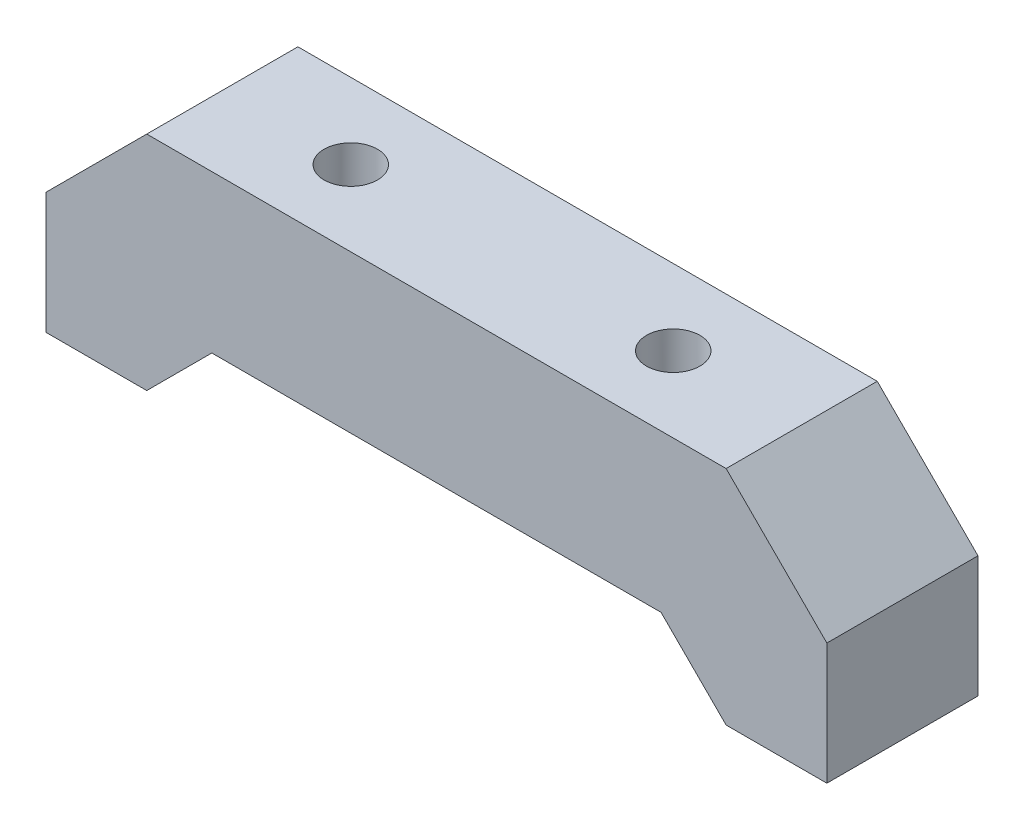
ISO-10303-21;
HEADER;
FILE_DESCRIPTION(('STEP AP214'),'2;1');
FILE_NAME('part.step','',(''),(''),'','','');
FILE_SCHEMA(('AUTOMOTIVE_DESIGN { 1 0 10303 214 1 1 1 1 }'));
ENDSEC;
DATA;
#1=APPLICATION_CONTEXT('core data for automotive mechanical design processes');
#2=APPLICATION_PROTOCOL_DEFINITION('international standard','automotive_design',2000,#1);
#3=PRODUCT_CONTEXT('',#1,'mechanical');
#4=PRODUCT('Part','Part','',(#3));
#5=PRODUCT_RELATED_PRODUCT_CATEGORY('part','',(#4));
#6=PRODUCT_DEFINITION_FORMATION('','',#4);
#7=PRODUCT_DEFINITION_CONTEXT('part definition',#1,'design');
#8=PRODUCT_DEFINITION('design','',#6,#7);
#9=PRODUCT_DEFINITION_SHAPE('','',#8);
#10=(LENGTH_UNIT() NAMED_UNIT(*) SI_UNIT(.MILLI.,.METRE.));
#11=(NAMED_UNIT(*) PLANE_ANGLE_UNIT() SI_UNIT($,.RADIAN.));
#12=(NAMED_UNIT(*) SI_UNIT($,.STERADIAN.) SOLID_ANGLE_UNIT());
#13=UNCERTAINTY_MEASURE_WITH_UNIT(LENGTH_MEASURE(1.E-05),#10,'distance_accuracy_value','');
#14=(GEOMETRIC_REPRESENTATION_CONTEXT(3) GLOBAL_UNCERTAINTY_ASSIGNED_CONTEXT((#13)) GLOBAL_UNIT_ASSIGNED_CONTEXT((#10,
#11,#12)) REPRESENTATION_CONTEXT('',''));
#15=CARTESIAN_POINT('',(0.,0.,0.));
#16=DIRECTION('',(0.,0.,1.));
#17=DIRECTION('',(1.,0.,0.));
#18=AXIS2_PLACEMENT_3D('',#15,#16,#17);
#19=CARTESIAN_POINT('',(22.8530411232495,-13.2789727585112,7.5));
#20=DIRECTION('',(0.,1.,0.));
#21=DIRECTION('',(0.,0.,1.));
#22=AXIS2_PLACEMENT_3D('',#19,#20,#21);
#23=CYLINDRICAL_SURFACE('',#22,2.65);
#24=CARTESIAN_POINT('',(22.8530411232495,8.76930503233844,7.5));
#25=DIRECTION('',(0.,1.,0.));
#26=DIRECTION('',(0.,0.,1.));
#27=AXIS2_PLACEMENT_3D('',#24,#25,#26);
#28=CIRCLE('',#27,2.65);
#29=CARTESIAN_POINT('',(22.8530411232495,8.76930503233844,10.15));
#30=VERTEX_POINT('',#29);
#31=EDGE_CURVE('E143',#30,#30,#28,.T.);
#32=ORIENTED_EDGE('',*,*,#31,.T.);
#33=EDGE_LOOP('',(#32));
#34=FACE_BOUND('',#33,.T.);
#35=CARTESIAN_POINT('',(22.8530411232495,-1.82118170705608,7.5));
#36=DIRECTION('',(0.,-1.,0.));
#37=DIRECTION('',(0.,0.,-1.));
#38=AXIS2_PLACEMENT_3D('',#35,#36,#37);
#39=CIRCLE('',#38,2.65);
#40=CARTESIAN_POINT('',(22.8530411232495,-1.82118170705608,4.85));
#41=VERTEX_POINT('',#40);
#42=EDGE_CURVE('E176',#41,#41,#39,.F.);
#43=ORIENTED_EDGE('',*,*,#42,.F.);
#44=EDGE_LOOP('',(#43));
#45=FACE_BOUND('',#44,.T.);
#46=ADVANCED_FACE('F31',(#34,#45),#23,.F.);
#47=CARTESIAN_POINT('',(90.1472529815433,-13.7749068259554,15.));
#48=DIRECTION('',(0.707106781186547,0.707106781186548,0.));
#49=DIRECTION('',(-0.707106781186548,0.707106781186547,0.));
#50=AXIS2_PLACEMENT_3D('',#47,#48,#49);
#51=PLANE('',#50);
#52=DIRECTION('',(0.707106781186548,-0.707106781186547,0.));
#53=VECTOR('',#52,1.);
#54=CARTESIAN_POINT('',(90.1472529815433,-13.7749068259554,0.));
#55=LINE('',#54,#53);
#56=CARTESIAN_POINT('',(67.6030411232495,8.76930503233844,0.));
#57=VERTEX_POINT('',#56);
#58=CARTESIAN_POINT('',(77.6030411232495,-1.23069496766157,0.));
#59=VERTEX_POINT('',#58);
#60=EDGE_CURVE('E139',#57,#59,#55,.T.);
#61=ORIENTED_EDGE('',*,*,#60,.F.);
#62=DIRECTION('',(0.,0.,-1.));
#63=VECTOR('',#62,1.);
#64=CARTESIAN_POINT('',(67.6030411232495,8.76930503233844,15.));
#65=LINE('',#64,#63);
#66=CARTESIAN_POINT('',(67.6030411232495,8.76930503233844,15.));
#67=VERTEX_POINT('',#66);
#68=EDGE_CURVE('E11',#67,#57,#65,.T.);
#69=ORIENTED_EDGE('',*,*,#68,.F.);
#70=DIRECTION('',(0.707106781186548,-0.707106781186547,0.));
#71=VECTOR('',#70,1.);
#72=CARTESIAN_POINT('',(90.1472529815433,-13.7749068259554,15.));
#73=LINE('',#72,#71);
#74=CARTESIAN_POINT('',(77.6030411232495,-1.23069496766157,15.));
#75=VERTEX_POINT('',#74);
#76=EDGE_CURVE('E162',#67,#75,#73,.T.);
#77=ORIENTED_EDGE('',*,*,#76,.T.);
#78=DIRECTION('',(0.,0.,-1.));
#79=VECTOR('',#78,1.);
#80=CARTESIAN_POINT('',(77.6030411232495,-1.23069496766157,15.));
#81=LINE('',#80,#79);
#82=EDGE_CURVE('E91',#75,#59,#81,.T.);
#83=ORIENTED_EDGE('',*,*,#82,.T.);
#84=EDGE_LOOP('',(#61,#69,#77,#83));
#85=FACE_BOUND('',#84,.T.);
#86=ADVANCED_FACE('F33',(#85),#51,.T.);
#87=CARTESIAN_POINT('',(38.8530411232495,8.76930503233844,15.));
#88=DIRECTION('',(0.,1.,0.));
#89=DIRECTION('',(0.,0.,1.));
#90=AXIS2_PLACEMENT_3D('',#87,#88,#89);
#91=PLANE('',#90);
#92=CARTESIAN_POINT('',(54.8530411232495,8.76930503233844,7.5));
#93=DIRECTION('',(0.,1.,0.));
#94=DIRECTION('',(0.,0.,-1.));
#95=AXIS2_PLACEMENT_3D('',#92,#93,#94);
#96=CIRCLE('',#95,2.65);
#97=CARTESIAN_POINT('',(54.8530411232495,8.76930503233844,4.85));
#98=VERTEX_POINT('',#97);
#99=EDGE_CURVE('E178',#98,#98,#96,.T.);
#100=ORIENTED_EDGE('',*,*,#99,.F.);
#101=EDGE_LOOP('',(#100));
#102=FACE_BOUND('',#101,.T.);
#103=ORIENTED_EDGE('',*,*,#31,.F.);
#104=EDGE_LOOP('',(#103));
#105=FACE_BOUND('',#104,.T.);
#106=DIRECTION('',(1.,0.,0.));
#107=VECTOR('',#106,1.);
#108=CARTESIAN_POINT('',(38.8530411232495,8.76930503233844,0.));
#109=LINE('',#108,#107);
#110=CARTESIAN_POINT('',(10.1030411232495,8.76930503233844,0.));
#111=VERTEX_POINT('',#110);
#112=EDGE_CURVE('E142',#111,#57,#109,.T.);
#113=ORIENTED_EDGE('',*,*,#112,.F.);
#114=DIRECTION('',(0.,0.,-1.));
#115=VECTOR('',#114,1.);
#116=CARTESIAN_POINT('',(10.1030411232495,8.76930503233844,15.));
#117=LINE('',#116,#115);
#118=CARTESIAN_POINT('',(10.1030411232495,8.76930503233844,15.));
#119=VERTEX_POINT('',#118);
#120=EDGE_CURVE('E41',#119,#111,#117,.T.);
#121=ORIENTED_EDGE('',*,*,#120,.F.);
#122=DIRECTION('',(1.,0.,0.));
#123=VECTOR('',#122,1.);
#124=CARTESIAN_POINT('',(38.8530411232495,8.76930503233844,15.));
#125=LINE('',#124,#123);
#126=EDGE_CURVE('E198',#119,#67,#125,.T.);
#127=ORIENTED_EDGE('',*,*,#126,.T.);
#128=ORIENTED_EDGE('',*,*,#68,.T.);
#129=EDGE_LOOP('',(#113,#121,#127,#128));
#130=FACE_BOUND('',#129,.T.);
#131=ADVANCED_FACE('F242',(#102,#105,#130),#91,.T.);
#132=CARTESIAN_POINT('',(-12.4411707350443,-13.7749068259554,15.));
#133=DIRECTION('',(0.707106781186547,-0.707106781186547,0.));
#134=DIRECTION('',(0.707106781186548,0.707106781186548,0.));
#135=AXIS2_PLACEMENT_3D('',#132,#133,#134);
#136=PLANE('',#135);
#137=DIRECTION('',(-0.707106781186548,-0.707106781186548,0.));
#138=VECTOR('',#137,1.);
#139=CARTESIAN_POINT('',(-12.4411707350443,-13.7749068259554,0.));
#140=LINE('',#139,#138);
#141=CARTESIAN_POINT('',(0.103041123249546,-1.23069496766155,0.));
#142=VERTEX_POINT('',#141);
#143=EDGE_CURVE('E146',#111,#142,#140,.T.);
#144=ORIENTED_EDGE('',*,*,#143,.T.);
#145=DIRECTION('',(0.,0.,-1.));
#146=VECTOR('',#145,1.);
#147=CARTESIAN_POINT('',(0.103041123249546,-1.23069496766155,15.));
#148=LINE('',#147,#146);
#149=CARTESIAN_POINT('',(0.103041123249546,-1.23069496766155,15.));
#150=VERTEX_POINT('',#149);
#151=EDGE_CURVE('E173',#150,#142,#148,.T.);
#152=ORIENTED_EDGE('',*,*,#151,.F.);
#153=DIRECTION('',(-0.707106781186548,-0.707106781186548,0.));
#154=VECTOR('',#153,1.);
#155=CARTESIAN_POINT('',(-12.4411707350443,-13.7749068259554,15.));
#156=LINE('',#155,#154);
#157=EDGE_CURVE('E201',#119,#150,#156,.T.);
#158=ORIENTED_EDGE('',*,*,#157,.F.);
#159=ORIENTED_EDGE('',*,*,#120,.T.);
#160=EDGE_LOOP('',(#144,#152,#158,#159));
#161=FACE_BOUND('',#160,.T.);
#162=ADVANCED_FACE('F397',(#161),#136,.F.);
#163=CARTESIAN_POINT('',(0.103041123249527,-65.0691186842492,15.));
#164=DIRECTION('',(1.,0.,0.));
#165=DIRECTION('',(0.,0.,-1.));
#166=AXIS2_PLACEMENT_3D('',#163,#164,#165);
#167=PLANE('',#166);
#168=DIRECTION('',(0.,-1.,0.));
#169=VECTOR('',#168,1.);
#170=CARTESIAN_POINT('',(0.103041123249527,-65.0691186842492,0.));
#171=LINE('',#170,#169);
#172=CARTESIAN_POINT('',(0.103041123249527,-13.2789727585112,0.));
#173=VERTEX_POINT('',#172);
#174=EDGE_CURVE('E148',#142,#173,#171,.T.);
#175=ORIENTED_EDGE('',*,*,#174,.T.);
#176=DIRECTION('',(0.,0.,-1.));
#177=VECTOR('',#176,1.);
#178=CARTESIAN_POINT('',(0.103041123249527,-13.2789727585112,15.));
#179=LINE('',#178,#177);
#180=CARTESIAN_POINT('',(0.103041123249527,-13.2789727585112,15.));
#181=VERTEX_POINT('',#180);
#182=EDGE_CURVE('E170',#181,#173,#179,.T.);
#183=ORIENTED_EDGE('',*,*,#182,.F.);
#184=DIRECTION('',(0.,-1.,0.));
#185=VECTOR('',#184,1.);
#186=CARTESIAN_POINT('',(0.103041123249527,-65.0691186842492,15.));
#187=LINE('',#186,#185);
#188=EDGE_CURVE('E203',#150,#181,#187,.T.);
#189=ORIENTED_EDGE('',*,*,#188,.F.);
#190=ORIENTED_EDGE('',*,*,#151,.T.);
#191=EDGE_LOOP('',(#175,#183,#189,#190));
#192=FACE_BOUND('',#191,.T.);
#193=ADVANCED_FACE('F389',(#192),#167,.F.);
#194=CARTESIAN_POINT('',(38.8530411232495,-13.2789727585112,15.));
#195=DIRECTION('',(0.,1.,0.));
#196=DIRECTION('',(0.,0.,1.));
#197=AXIS2_PLACEMENT_3D('',#194,#195,#196);
#198=PLANE('',#197);
#199=DIRECTION('',(1.,0.,0.));
#200=VECTOR('',#199,1.);
#201=CARTESIAN_POINT('',(38.8530411232495,-13.2789727585112,0.));
#202=LINE('',#201,#200);
#203=CARTESIAN_POINT('',(10.1030411232495,-13.2789727585112,0.));
#204=VERTEX_POINT('',#203);
#205=EDGE_CURVE('E150',#173,#204,#202,.T.);
#206=ORIENTED_EDGE('',*,*,#205,.T.);
#207=DIRECTION('',(0.,0.,-1.));
#208=VECTOR('',#207,1.);
#209=CARTESIAN_POINT('',(10.1030411232495,-13.2789727585112,15.));
#210=LINE('',#209,#208);
#211=CARTESIAN_POINT('',(10.1030411232495,-13.2789727585112,15.));
#212=VERTEX_POINT('',#211);
#213=EDGE_CURVE('E168',#212,#204,#210,.T.);
#214=ORIENTED_EDGE('',*,*,#213,.F.);
#215=DIRECTION('',(1.,0.,0.));
#216=VECTOR('',#215,1.);
#217=CARTESIAN_POINT('',(38.8530411232495,-13.2789727585112,15.));
#218=LINE('',#217,#216);
#219=EDGE_CURVE('E205',#181,#212,#218,.T.);
#220=ORIENTED_EDGE('',*,*,#219,.F.);
#221=ORIENTED_EDGE('',*,*,#182,.T.);
#222=EDGE_LOOP('',(#206,#214,#220,#221));
#223=FACE_BOUND('',#222,.T.);
#224=ADVANCED_FACE('F217',(#223),#198,.F.);
#225=CARTESIAN_POINT('',(-1.41703183961947,-24.7990457213802,15.));
#226=DIRECTION('',(0.707106781186547,-0.707106781186547,0.));
#227=DIRECTION('',(0.707106781186548,0.707106781186548,0.));
#228=AXIS2_PLACEMENT_3D('',#225,#226,#227);
#229=PLANE('',#228);
#230=DIRECTION('',(-0.707106781186548,-0.707106781186548,0.));
#231=VECTOR('',#230,1.);
#232=CARTESIAN_POINT('',(-1.41703183961947,-24.7990457213802,0.));
#233=LINE('',#232,#231);
#234=CARTESIAN_POINT('',(16.5608321747046,-6.8211817070561,0.));
#235=VERTEX_POINT('',#234);
#236=EDGE_CURVE('E153',#235,#204,#233,.T.);
#237=ORIENTED_EDGE('',*,*,#236,.F.);
#238=DIRECTION('',(0.,0.,-1.));
#239=VECTOR('',#238,1.);
#240=CARTESIAN_POINT('',(16.5608321747046,-6.8211817070561,15.));
#241=LINE('',#240,#239);
#242=CARTESIAN_POINT('',(16.5608321747046,-6.8211817070561,15.));
#243=VERTEX_POINT('',#242);
#244=EDGE_CURVE('E166',#243,#235,#241,.T.);
#245=ORIENTED_EDGE('',*,*,#244,.F.);
#246=DIRECTION('',(-0.707106781186548,-0.707106781186548,0.));
#247=VECTOR('',#246,1.);
#248=CARTESIAN_POINT('',(-1.41703183961947,-24.7990457213802,15.));
#249=LINE('',#248,#247);
#250=EDGE_CURVE('E207',#243,#212,#249,.T.);
#251=ORIENTED_EDGE('',*,*,#250,.T.);
#252=ORIENTED_EDGE('',*,*,#213,.T.);
#253=EDGE_LOOP('',(#237,#245,#251,#252));
#254=FACE_BOUND('',#253,.T.);
#255=ADVANCED_FACE('F211',(#254),#229,.T.);
#256=CARTESIAN_POINT('',(38.8530411232495,-6.82118170705608,15.));
#257=DIRECTION('',(0.,1.,0.));
#258=DIRECTION('',(0.,0.,1.));
#259=AXIS2_PLACEMENT_3D('',#256,#257,#258);
#260=PLANE('',#259);
#261=CARTESIAN_POINT('',(54.8530411232495,-6.82118170705608,7.5));
#262=DIRECTION('',(0.,-1.,0.));
#263=DIRECTION('',(0.,0.,1.));
#264=AXIS2_PLACEMENT_3D('',#261,#262,#263);
#265=CIRCLE('',#264,4.5);
#266=CARTESIAN_POINT('',(54.8530411232495,-6.82118170705608,12.));
#267=VERTEX_POINT('',#266);
#268=EDGE_CURVE('E192',#267,#267,#265,.T.);
#269=ORIENTED_EDGE('',*,*,#268,.F.);
#270=EDGE_LOOP('',(#269));
#271=FACE_BOUND('',#270,.T.);
#272=CARTESIAN_POINT('',(22.8530411232495,-6.82118170705608,7.5));
#273=DIRECTION('',(0.,-1.,0.));
#274=DIRECTION('',(0.,0.,-1.));
#275=AXIS2_PLACEMENT_3D('',#272,#273,#274);
#276=CIRCLE('',#275,4.5);
#277=CARTESIAN_POINT('',(22.8530411232495,-6.82118170705608,3.));
#278=VERTEX_POINT('',#277);
#279=EDGE_CURVE('E185',#278,#278,#276,.T.);
#280=ORIENTED_EDGE('',*,*,#279,.F.);
#281=EDGE_LOOP('',(#280));
#282=FACE_BOUND('',#281,.T.);
#283=DIRECTION('',(1.,0.,0.));
#284=VECTOR('',#283,1.);
#285=CARTESIAN_POINT('',(38.8530411232495,-6.82118170705608,0.));
#286=LINE('',#285,#284);
#287=CARTESIAN_POINT('',(61.1452500717944,-6.82118170705609,0.));
#288=VERTEX_POINT('',#287);
#289=EDGE_CURVE('E156',#235,#288,#286,.T.);
#290=ORIENTED_EDGE('',*,*,#289,.T.);
#291=DIRECTION('',(0.,0.,-1.));
#292=VECTOR('',#291,1.);
#293=CARTESIAN_POINT('',(61.1452500717944,-6.82118170705609,15.));
#294=LINE('',#293,#292);
#295=CARTESIAN_POINT('',(61.1452500717944,-6.82118170705609,15.));
#296=VERTEX_POINT('',#295);
#297=EDGE_CURVE('E131',#296,#288,#294,.T.);
#298=ORIENTED_EDGE('',*,*,#297,.F.);
#299=DIRECTION('',(1.,0.,0.));
#300=VECTOR('',#299,1.);
#301=CARTESIAN_POINT('',(38.8530411232495,-6.82118170705608,15.));
#302=LINE('',#301,#300);
#303=EDGE_CURVE('E122',#243,#296,#302,.T.);
#304=ORIENTED_EDGE('',*,*,#303,.F.);
#305=ORIENTED_EDGE('',*,*,#244,.T.);
#306=EDGE_LOOP('',(#290,#298,#304,#305));
#307=FACE_BOUND('',#306,.T.);
#308=ADVANCED_FACE('F224',(#271,#282,#307),#260,.F.);
#309=CARTESIAN_POINT('',(79.1231140861185,-24.7990457213802,15.));
#310=DIRECTION('',(0.707106781186547,0.707106781186548,0.));
#311=DIRECTION('',(-0.707106781186548,0.707106781186547,0.));
#312=AXIS2_PLACEMENT_3D('',#309,#310,#311);
#313=PLANE('',#312);
#314=DIRECTION('',(0.707106781186548,-0.707106781186547,0.));
#315=VECTOR('',#314,1.);
#316=CARTESIAN_POINT('',(79.1231140861185,-24.7990457213802,0.));
#317=LINE('',#316,#315);
#318=CARTESIAN_POINT('',(67.6030411232495,-13.2789727585112,0.));
#319=VERTEX_POINT('',#318);
#320=EDGE_CURVE('E130',#288,#319,#317,.T.);
#321=ORIENTED_EDGE('',*,*,#320,.T.);
#322=DIRECTION('',(0.,0.,-1.));
#323=VECTOR('',#322,1.);
#324=CARTESIAN_POINT('',(67.6030411232495,-13.2789727585112,15.));
#325=LINE('',#324,#323);
#326=CARTESIAN_POINT('',(67.6030411232495,-13.2789727585112,15.));
#327=VERTEX_POINT('',#326);
#328=EDGE_CURVE('E127',#327,#319,#325,.T.);
#329=ORIENTED_EDGE('',*,*,#328,.F.);
#330=DIRECTION('',(0.707106781186548,-0.707106781186547,0.));
#331=VECTOR('',#330,1.);
#332=CARTESIAN_POINT('',(79.1231140861185,-24.7990457213802,15.));
#333=LINE('',#332,#331);
#334=EDGE_CURVE('E115',#296,#327,#333,.T.);
#335=ORIENTED_EDGE('',*,*,#334,.F.);
#336=ORIENTED_EDGE('',*,*,#297,.T.);
#337=EDGE_LOOP('',(#321,#329,#335,#336));
#338=FACE_BOUND('',#337,.T.);
#339=ADVANCED_FACE('F128',(#338),#313,.F.);
#340=CARTESIAN_POINT('',(38.8530411232495,-13.2789727585112,15.));
#341=DIRECTION('',(0.,1.,0.));
#342=DIRECTION('',(0.,0.,1.));
#343=AXIS2_PLACEMENT_3D('',#340,#341,#342);
#344=PLANE('',#343);
#345=DIRECTION('',(1.,0.,0.));
#346=VECTOR('',#345,1.);
#347=CARTESIAN_POINT('',(38.8530411232495,-13.2789727585112,0.));
#348=LINE('',#347,#346);
#349=CARTESIAN_POINT('',(77.6030411232495,-13.2789727585112,0.));
#350=VERTEX_POINT('',#349);
#351=EDGE_CURVE('E84',#319,#350,#348,.T.);
#352=ORIENTED_EDGE('',*,*,#351,.T.);
#353=DIRECTION('',(0.,0.,-1.));
#354=VECTOR('',#353,1.);
#355=CARTESIAN_POINT('',(77.6030411232495,-13.2789727585112,15.));
#356=LINE('',#355,#354);
#357=CARTESIAN_POINT('',(77.6030411232495,-13.2789727585112,15.));
#358=VERTEX_POINT('',#357);
#359=EDGE_CURVE('E132',#358,#350,#356,.T.);
#360=ORIENTED_EDGE('',*,*,#359,.F.);
#361=DIRECTION('',(1.,0.,0.));
#362=VECTOR('',#361,1.);
#363=CARTESIAN_POINT('',(38.8530411232495,-13.2789727585112,15.));
#364=LINE('',#363,#362);
#365=EDGE_CURVE('E119',#327,#358,#364,.T.);
#366=ORIENTED_EDGE('',*,*,#365,.F.);
#367=ORIENTED_EDGE('',*,*,#328,.T.);
#368=EDGE_LOOP('',(#352,#360,#366,#367));
#369=FACE_BOUND('',#368,.T.);
#370=ADVANCED_FACE('F134',(#369),#344,.F.);
#371=CARTESIAN_POINT('',(77.6030411232495,-65.0691186842492,15.));
#372=DIRECTION('',(-1.,0.,0.));
#373=DIRECTION('',(0.,0.,1.));
#374=AXIS2_PLACEMENT_3D('',#371,#372,#373);
#375=PLANE('',#374);
#376=DIRECTION('',(0.,1.,0.));
#377=VECTOR('',#376,1.);
#378=CARTESIAN_POINT('',(77.6030411232495,-65.0691186842492,0.));
#379=LINE('',#378,#377);
#380=EDGE_CURVE('E160',#350,#59,#379,.T.);
#381=ORIENTED_EDGE('',*,*,#380,.T.);
#382=ORIENTED_EDGE('',*,*,#82,.F.);
#383=DIRECTION('',(0.,1.,0.));
#384=VECTOR('',#383,1.);
#385=CARTESIAN_POINT('',(77.6030411232495,-65.0691186842492,15.));
#386=LINE('',#385,#384);
#387=EDGE_CURVE('E50',#358,#75,#386,.T.);
#388=ORIENTED_EDGE('',*,*,#387,.F.);
#389=ORIENTED_EDGE('',*,*,#359,.T.);
#390=EDGE_LOOP('',(#381,#382,#388,#389));
#391=FACE_BOUND('',#390,.T.);
#392=ADVANCED_FACE('F250',(#391),#375,.F.);
#393=CARTESIAN_POINT('',(38.8530411232495,-65.0691186842492,15.));
#394=DIRECTION('',(0.,0.,1.));
#395=DIRECTION('',(1.,0.,0.));
#396=AXIS2_PLACEMENT_3D('',#393,#394,#395);
#397=PLANE('',#396);
#398=ORIENTED_EDGE('',*,*,#76,.F.);
#399=ORIENTED_EDGE('',*,*,#126,.F.);
#400=ORIENTED_EDGE('',*,*,#157,.T.);
#401=ORIENTED_EDGE('',*,*,#188,.T.);
#402=ORIENTED_EDGE('',*,*,#219,.T.);
#403=ORIENTED_EDGE('',*,*,#250,.F.);
#404=ORIENTED_EDGE('',*,*,#303,.T.);
#405=ORIENTED_EDGE('',*,*,#334,.T.);
#406=ORIENTED_EDGE('',*,*,#365,.T.);
#407=ORIENTED_EDGE('',*,*,#387,.T.);
#408=EDGE_LOOP('',(#398,#399,#400,#401,#402,#403,#404,#405,#406,#407));
#409=FACE_BOUND('',#408,.T.);
#410=ADVANCED_FACE('F117',(#409),#397,.T.);
#411=CARTESIAN_POINT('',(38.8530411232495,-65.0691186842492,0.));
#412=DIRECTION('',(0.,0.,1.));
#413=DIRECTION('',(1.,0.,0.));
#414=AXIS2_PLACEMENT_3D('',#411,#412,#413);
#415=PLANE('',#414);
#416=ORIENTED_EDGE('',*,*,#60,.T.);
#417=ORIENTED_EDGE('',*,*,#380,.F.);
#418=ORIENTED_EDGE('',*,*,#351,.F.);
#419=ORIENTED_EDGE('',*,*,#320,.F.);
#420=ORIENTED_EDGE('',*,*,#289,.F.);
#421=ORIENTED_EDGE('',*,*,#236,.T.);
#422=ORIENTED_EDGE('',*,*,#205,.F.);
#423=ORIENTED_EDGE('',*,*,#174,.F.);
#424=ORIENTED_EDGE('',*,*,#143,.F.);
#425=ORIENTED_EDGE('',*,*,#112,.T.);
#426=EDGE_LOOP('',(#416,#417,#418,#419,#420,#421,#422,#423,#424,#425));
#427=FACE_BOUND('',#426,.T.);
#428=ADVANCED_FACE('F222',(#427),#415,.F.);
#429=CARTESIAN_POINT('',(54.8530411232495,-13.2789727585112,7.5));
#430=DIRECTION('',(0.,1.,0.));
#431=DIRECTION('',(0.,0.,1.));
#432=AXIS2_PLACEMENT_3D('',#429,#430,#431);
#433=CYLINDRICAL_SURFACE('',#432,2.65);
#434=CARTESIAN_POINT('',(54.8530411232495,-1.82118170705608,7.5));
#435=DIRECTION('',(0.,1.,0.));
#436=DIRECTION('',(0.,0.,1.));
#437=AXIS2_PLACEMENT_3D('',#434,#435,#436);
#438=CIRCLE('',#437,2.65);
#439=CARTESIAN_POINT('',(54.8530411232495,-1.82118170705608,10.15));
#440=VERTEX_POINT('',#439);
#441=EDGE_CURVE('E35',#440,#440,#438,.F.);
#442=ORIENTED_EDGE('',*,*,#441,.T.);
#443=EDGE_LOOP('',(#442));
#444=FACE_BOUND('',#443,.T.);
#445=ORIENTED_EDGE('',*,*,#99,.T.);
#446=EDGE_LOOP('',(#445));
#447=FACE_BOUND('',#446,.T.);
#448=ADVANCED_FACE('F246',(#444,#447),#433,.F.);
#449=CARTESIAN_POINT('',(22.8530411232495,-1.82118170705608,7.5));
#450=DIRECTION('',(0.,-1.,0.));
#451=DIRECTION('',(0.,0.,-1.));
#452=AXIS2_PLACEMENT_3D('',#449,#450,#451);
#453=PLANE('',#452);
#454=CARTESIAN_POINT('',(22.8530411232495,-1.82118170705608,7.5));
#455=DIRECTION('',(0.,-1.,0.));
#456=DIRECTION('',(0.,0.,-1.));
#457=AXIS2_PLACEMENT_3D('',#454,#455,#456);
#458=CIRCLE('',#457,4.5);
#459=CARTESIAN_POINT('',(22.8530411232495,-1.82118170705608,3.));
#460=VERTEX_POINT('',#459);
#461=EDGE_CURVE('E179',#460,#460,#458,.T.);
#462=ORIENTED_EDGE('',*,*,#461,.T.);
#463=EDGE_LOOP('',(#462));
#464=FACE_BOUND('',#463,.T.);
#465=ORIENTED_EDGE('',*,*,#42,.T.);
#466=EDGE_LOOP('',(#465));
#467=FACE_BOUND('',#466,.T.);
#468=ADVANCED_FACE('F280',(#464,#467),#453,.T.);
#469=CARTESIAN_POINT('',(22.8530411232495,-1.82118170705608,7.5));
#470=DIRECTION('',(0.,-1.,0.));
#471=DIRECTION('',(0.,0.,-1.));
#472=AXIS2_PLACEMENT_3D('',#469,#470,#471);
#473=CYLINDRICAL_SURFACE('',#472,4.5);
#474=ORIENTED_EDGE('',*,*,#461,.F.);
#475=EDGE_LOOP('',(#474));
#476=FACE_BOUND('',#475,.T.);
#477=ORIENTED_EDGE('',*,*,#279,.T.);
#478=EDGE_LOOP('',(#477));
#479=FACE_BOUND('',#478,.T.);
#480=ADVANCED_FACE('F287',(#476,#479),#473,.F.);
#481=CARTESIAN_POINT('',(54.8530411232495,-1.82118170705608,7.5));
#482=DIRECTION('',(0.,1.,0.));
#483=DIRECTION('',(0.,0.,1.));
#484=AXIS2_PLACEMENT_3D('',#481,#482,#483);
#485=PLANE('',#484);
#486=CARTESIAN_POINT('',(54.8530411232495,-1.82118170705608,7.5));
#487=DIRECTION('',(0.,-1.,0.));
#488=DIRECTION('',(0.,0.,1.));
#489=AXIS2_PLACEMENT_3D('',#486,#487,#488);
#490=CIRCLE('',#489,4.5);
#491=CARTESIAN_POINT('',(54.8530411232495,-1.82118170705608,12.));
#492=VERTEX_POINT('',#491);
#493=EDGE_CURVE('E439',#492,#492,#490,.T.);
#494=ORIENTED_EDGE('',*,*,#493,.T.);
#495=EDGE_LOOP('',(#494));
#496=FACE_BOUND('',#495,.T.);
#497=ORIENTED_EDGE('',*,*,#441,.F.);
#498=EDGE_LOOP('',(#497));
#499=FACE_BOUND('',#498,.T.);
#500=ADVANCED_FACE('F294',(#496,#499),#485,.F.);
#501=CARTESIAN_POINT('',(54.8530411232495,-1.82118170705608,7.5));
#502=DIRECTION('',(0.,-1.,0.));
#503=DIRECTION('',(0.,0.,-1.));
#504=AXIS2_PLACEMENT_3D('',#501,#502,#503);
#505=CYLINDRICAL_SURFACE('',#504,4.5);
#506=ORIENTED_EDGE('',*,*,#493,.F.);
#507=EDGE_LOOP('',(#506));
#508=FACE_BOUND('',#507,.T.);
#509=ORIENTED_EDGE('',*,*,#268,.T.);
#510=EDGE_LOOP('',(#509));
#511=FACE_BOUND('',#510,.T.);
#512=ADVANCED_FACE('F301',(#508,#511),#505,.F.);
#513=CLOSED_SHELL('',(#46,#86,#131,#162,#193,#224,#255,#308,#339,#370,#392,#410,#428,#448,#468,
#480,#500,#512));
#514=MANIFOLD_SOLID_BREP('B2',#513);
#515=ADVANCED_BREP_SHAPE_REPRESENTATION('',(#18,#514),#14);
#516=SHAPE_DEFINITION_REPRESENTATION(#9,#515);
ENDSEC;
END-ISO-10303-21;
